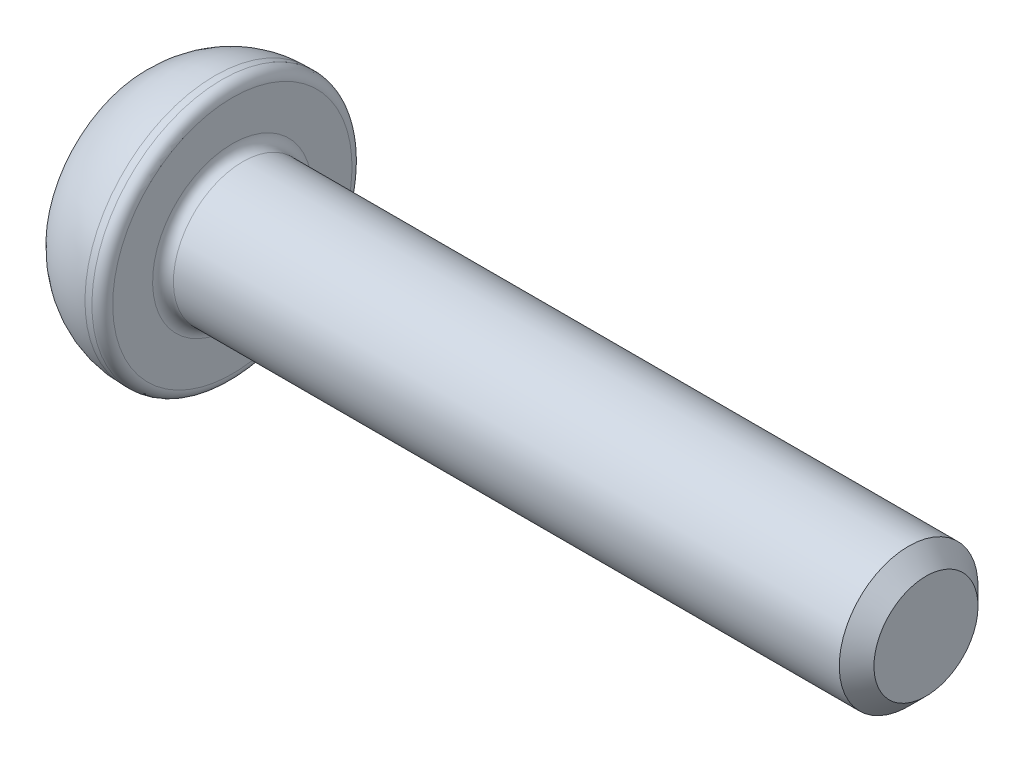
ISO-10303-21;
HEADER;
FILE_DESCRIPTION(('STEP AP214'),'2;1');
FILE_NAME('part.step','',(''),(''),'','','');
FILE_SCHEMA(('AUTOMOTIVE_DESIGN { 1 0 10303 214 1 1 1 1 }'));
ENDSEC;
DATA;
#1=APPLICATION_CONTEXT('core data for automotive mechanical design processes');
#2=APPLICATION_PROTOCOL_DEFINITION('international standard','automotive_design',2000,#1);
#3=PRODUCT_CONTEXT('',#1,'mechanical');
#4=PRODUCT('Part','Part','',(#3));
#5=PRODUCT_RELATED_PRODUCT_CATEGORY('part','',(#4));
#6=PRODUCT_DEFINITION_FORMATION('','',#4);
#7=PRODUCT_DEFINITION_CONTEXT('part definition',#1,'design');
#8=PRODUCT_DEFINITION('design','',#6,#7);
#9=PRODUCT_DEFINITION_SHAPE('','',#8);
#10=(LENGTH_UNIT() NAMED_UNIT(*) SI_UNIT(.MILLI.,.METRE.));
#11=(NAMED_UNIT(*) PLANE_ANGLE_UNIT() SI_UNIT($,.RADIAN.));
#12=(NAMED_UNIT(*) SI_UNIT($,.STERADIAN.) SOLID_ANGLE_UNIT());
#13=UNCERTAINTY_MEASURE_WITH_UNIT(LENGTH_MEASURE(1.E-05),#10,'distance_accuracy_value','');
#14=(GEOMETRIC_REPRESENTATION_CONTEXT(3) GLOBAL_UNCERTAINTY_ASSIGNED_CONTEXT((#13)) GLOBAL_UNIT_ASSIGNED_CONTEXT((#10,
#11,#12)) REPRESENTATION_CONTEXT('',''));
#15=CARTESIAN_POINT('',(0.,0.,0.));
#16=DIRECTION('',(0.,0.,1.));
#17=DIRECTION('',(1.,0.,0.));
#18=AXIS2_PLACEMENT_3D('',#15,#16,#17);
#19=CARTESIAN_POINT('',(0.,0.,0.));
#20=DIRECTION('',(-1.,0.,0.));
#21=DIRECTION('',(0.,-1.,0.));
#22=AXIS2_PLACEMENT_3D('',#19,#20,#21);
#23=PLANE('',#22);
#24=DIRECTION('',(0.,0.866025403784438,-0.5));
#25=VECTOR('',#24,1.);
#26=CARTESIAN_POINT('',(0.,0.,1.44337567297407));
#27=LINE('',#26,#25);
#28=CARTESIAN_POINT('',(0.,0.,1.44337567297407));
#29=VERTEX_POINT('',#28);
#30=CARTESIAN_POINT('',(0.,1.25,0.721687836487032));
#31=VERTEX_POINT('',#30);
#32=EDGE_CURVE('E55',#29,#31,#27,.T.);
#33=ORIENTED_EDGE('',*,*,#32,.F.);
#34=DIRECTION('',(0.,0.866025403784438,0.5));
#35=VECTOR('',#34,1.);
#36=CARTESIAN_POINT('',(0.,-1.25,0.721687836487033));
#37=LINE('',#36,#35);
#38=CARTESIAN_POINT('',(0.,-1.25,0.721687836487033));
#39=VERTEX_POINT('',#38);
#40=EDGE_CURVE('E138',#39,#29,#37,.T.);
#41=ORIENTED_EDGE('',*,*,#40,.F.);
#42=DIRECTION('',(0.,0.,1.));
#43=VECTOR('',#42,1.);
#44=CARTESIAN_POINT('',(0.,-1.25,-0.721687836487032));
#45=LINE('',#44,#43);
#46=CARTESIAN_POINT('',(0.,-1.25,-0.721687836487032));
#47=VERTEX_POINT('',#46);
#48=EDGE_CURVE('E136',#47,#39,#45,.T.);
#49=ORIENTED_EDGE('',*,*,#48,.F.);
#50=DIRECTION('',(0.,-0.866025403784438,0.5));
#51=VECTOR('',#50,1.);
#52=CARTESIAN_POINT('',(0.,0.,-1.44337567297407));
#53=LINE('',#52,#51);
#54=CARTESIAN_POINT('',(0.,0.,-1.44337567297407));
#55=VERTEX_POINT('',#54);
#56=EDGE_CURVE('E103',#55,#47,#53,.T.);
#57=ORIENTED_EDGE('',*,*,#56,.F.);
#58=DIRECTION('',(0.,-0.866025403784438,-0.5));
#59=VECTOR('',#58,1.);
#60=CARTESIAN_POINT('',(0.,1.25,-0.721687836487032));
#61=LINE('',#60,#59);
#62=CARTESIAN_POINT('',(0.,1.25,-0.721687836487032));
#63=VERTEX_POINT('',#62);
#64=EDGE_CURVE('E132',#63,#55,#61,.T.);
#65=ORIENTED_EDGE('',*,*,#64,.F.);
#66=DIRECTION('',(0.,0.,-1.));
#67=VECTOR('',#66,1.);
#68=CARTESIAN_POINT('',(0.,1.25,0.721687836487032));
#69=LINE('',#68,#67);
#70=EDGE_CURVE('E129',#31,#63,#69,.T.);
#71=ORIENTED_EDGE('',*,*,#70,.F.);
#72=EDGE_LOOP('',(#33,#41,#49,#57,#65,#71));
#73=FACE_BOUND('',#72,.T.);
#74=CARTESIAN_POINT('',(0.,0.,0.));
#75=DIRECTION('',(1.,0.,0.));
#76=DIRECTION('',(0.,1.,0.));
#77=AXIS2_PLACEMENT_3D('',#74,#75,#76);
#78=CIRCLE('',#77,2.875);
#79=CARTESIAN_POINT('',(0.,2.875,0.));
#80=VERTEX_POINT('',#79);
#81=EDGE_CURVE('E150',#80,#80,#78,.T.);
#82=ORIENTED_EDGE('',*,*,#81,.F.);
#83=EDGE_LOOP('',(#82));
#84=FACE_BOUND('',#83,.T.);
#85=ADVANCED_FACE('F39',(#73,#84),#23,.T.);
#86=CARTESIAN_POINT('',(2.,0.,0.));
#87=DIRECTION('',(1.,0.,0.));
#88=DIRECTION('',(0.,1.,0.));
#89=AXIS2_PLACEMENT_3D('',#86,#87,#88);
#90=DEGENERATE_TOROIDAL_SURFACE('',#89,1.02678571428571,2.72321428571429,.T.);
#91=ORIENTED_EDGE('',*,*,#81,.T.);
#92=EDGE_LOOP('',(#91));
#93=FACE_BOUND('',#92,.T.);
#94=CARTESIAN_POINT('',(2.,0.,0.));
#95=DIRECTION('',(1.,0.,0.));
#96=DIRECTION('',(0.,1.,0.));
#97=AXIS2_PLACEMENT_3D('',#94,#95,#96);
#98=CIRCLE('',#97,3.75);
#99=CARTESIAN_POINT('',(2.,3.75,0.));
#100=VERTEX_POINT('',#99);
#101=EDGE_CURVE('E142',#100,#100,#98,.T.);
#102=ORIENTED_EDGE('',*,*,#101,.F.);
#103=EDGE_LOOP('',(#102));
#104=FACE_BOUND('',#103,.T.);
#105=ADVANCED_FACE('F179',(#93,#104),#90,.T.);
#106=CARTESIAN_POINT('',(22.5,0.,0.));
#107=DIRECTION('',(1.,0.,0.));
#108=DIRECTION('',(0.,1.,0.));
#109=AXIS2_PLACEMENT_3D('',#106,#107,#108);
#110=CYLINDRICAL_SURFACE('',#109,3.75);
#111=CARTESIAN_POINT('',(2.2,0.,0.));
#112=DIRECTION('',(1.,0.,0.));
#113=DIRECTION('',(0.,1.,0.));
#114=AXIS2_PLACEMENT_3D('',#111,#112,#113);
#115=CIRCLE('',#114,3.75);
#116=CARTESIAN_POINT('',(2.2,3.75,0.));
#117=VERTEX_POINT('',#116);
#118=EDGE_CURVE('E162',#117,#117,#115,.F.);
#119=ORIENTED_EDGE('',*,*,#118,.T.);
#120=EDGE_LOOP('',(#119));
#121=FACE_BOUND('',#120,.T.);
#122=ORIENTED_EDGE('',*,*,#101,.T.);
#123=EDGE_LOOP('',(#122));
#124=FACE_BOUND('',#123,.T.);
#125=ADVANCED_FACE('F185',(#121,#124),#110,.T.);
#126=CARTESIAN_POINT('',(2.5,3.75,0.));
#127=DIRECTION('',(1.,0.,0.));
#128=DIRECTION('',(0.,1.,0.));
#129=AXIS2_PLACEMENT_3D('',#126,#127,#128);
#130=PLANE('',#129);
#131=CARTESIAN_POINT('',(2.5,0.,0.));
#132=DIRECTION('',(1.,0.,0.));
#133=DIRECTION('',(0.,1.,0.));
#134=AXIS2_PLACEMENT_3D('',#131,#132,#133);
#135=CIRCLE('',#134,2.3);
#136=CARTESIAN_POINT('',(2.5,2.3,0.));
#137=VERTEX_POINT('',#136);
#138=EDGE_CURVE('E159',#137,#137,#135,.F.);
#139=ORIENTED_EDGE('',*,*,#138,.T.);
#140=EDGE_LOOP('',(#139));
#141=FACE_BOUND('',#140,.T.);
#142=CARTESIAN_POINT('',(2.5,0.,0.));
#143=DIRECTION('',(1.,0.,0.));
#144=DIRECTION('',(0.,1.,0.));
#145=AXIS2_PLACEMENT_3D('',#142,#143,#144);
#146=CIRCLE('',#145,3.45);
#147=CARTESIAN_POINT('',(2.5,3.45,0.));
#148=VERTEX_POINT('',#147);
#149=EDGE_CURVE('E156',#148,#148,#146,.T.);
#150=ORIENTED_EDGE('',*,*,#149,.T.);
#151=EDGE_LOOP('',(#150));
#152=FACE_BOUND('',#151,.T.);
#153=ADVANCED_FACE('F204',(#141,#152),#130,.T.);
#154=CARTESIAN_POINT('',(22.5,0.,0.));
#155=DIRECTION('',(1.,0.,0.));
#156=DIRECTION('',(0.,1.,0.));
#157=AXIS2_PLACEMENT_3D('',#154,#155,#156);
#158=CYLINDRICAL_SURFACE('',#157,2.);
#159=CARTESIAN_POINT('',(22.,0.,0.));
#160=DIRECTION('',(1.,0.,0.));
#161=DIRECTION('',(0.,1.,0.));
#162=AXIS2_PLACEMENT_3D('',#159,#160,#161);
#163=CIRCLE('',#162,2.);
#164=CARTESIAN_POINT('',(22.,2.,0.));
#165=VERTEX_POINT('',#164);
#166=EDGE_CURVE('E11',#165,#165,#163,.F.);
#167=ORIENTED_EDGE('',*,*,#166,.T.);
#168=EDGE_LOOP('',(#167));
#169=FACE_BOUND('',#168,.T.);
#170=CARTESIAN_POINT('',(2.8,0.,0.));
#171=DIRECTION('',(1.,0.,0.));
#172=DIRECTION('',(0.,1.,0.));
#173=AXIS2_PLACEMENT_3D('',#170,#171,#172);
#174=CIRCLE('',#173,2.);
#175=CARTESIAN_POINT('',(2.8,2.,0.));
#176=VERTEX_POINT('',#175);
#177=EDGE_CURVE('E153',#176,#176,#174,.T.);
#178=ORIENTED_EDGE('',*,*,#177,.T.);
#179=EDGE_LOOP('',(#178));
#180=FACE_BOUND('',#179,.T.);
#181=ADVANCED_FACE('F202',(#169,#180),#158,.T.);
#182=CARTESIAN_POINT('',(22.5,2.,0.));
#183=DIRECTION('',(1.,0.,0.));
#184=DIRECTION('',(0.,1.,0.));
#185=AXIS2_PLACEMENT_3D('',#182,#183,#184);
#186=PLANE('',#185);
#187=CARTESIAN_POINT('',(22.5,0.,0.));
#188=DIRECTION('',(1.,0.,0.));
#189=DIRECTION('',(0.,1.,0.));
#190=AXIS2_PLACEMENT_3D('',#187,#188,#189);
#191=CIRCLE('',#190,1.5);
#192=CARTESIAN_POINT('',(22.5,1.5,0.));
#193=VERTEX_POINT('',#192);
#194=EDGE_CURVE('E48',#193,#193,#191,.T.);
#195=ORIENTED_EDGE('',*,*,#194,.T.);
#196=EDGE_LOOP('',(#195));
#197=FACE_BOUND('',#196,.T.);
#198=ADVANCED_FACE('F167',(#197),#186,.T.);
#199=CARTESIAN_POINT('',(1.5,0.,1.44337567297407));
#200=DIRECTION('',(0.,0.5,0.866025403784438));
#201=DIRECTION('',(0.,-0.866025403784439,0.5));
#202=AXIS2_PLACEMENT_3D('',#199,#200,#201);
#203=PLANE('',#202);
#204=ORIENTED_EDGE('',*,*,#32,.T.);
#205=DIRECTION('',(-1.,0.,0.));
#206=VECTOR('',#205,1.);
#207=CARTESIAN_POINT('',(1.5,1.25,0.721687836487032));
#208=LINE('',#207,#206);
#209=CARTESIAN_POINT('',(1.5,1.25,0.721687836487032));
#210=VERTEX_POINT('',#209);
#211=EDGE_CURVE('E85',#210,#31,#208,.T.);
#212=ORIENTED_EDGE('',*,*,#211,.F.);
#213=DIRECTION('',(0.,0.866025403784438,-0.5));
#214=VECTOR('',#213,1.);
#215=CARTESIAN_POINT('',(1.5,0.,1.44337567297407));
#216=LINE('',#215,#214);
#217=CARTESIAN_POINT('',(1.5,0.,1.44337567297407));
#218=VERTEX_POINT('',#217);
#219=EDGE_CURVE('E140',#218,#210,#216,.T.);
#220=ORIENTED_EDGE('',*,*,#219,.F.);
#221=DIRECTION('',(-1.,0.,0.));
#222=VECTOR('',#221,1.);
#223=CARTESIAN_POINT('',(1.5,0.,1.44337567297407));
#224=LINE('',#223,#222);
#225=EDGE_CURVE('E63',#218,#29,#224,.T.);
#226=ORIENTED_EDGE('',*,*,#225,.T.);
#227=EDGE_LOOP('',(#204,#212,#220,#226));
#228=FACE_BOUND('',#227,.T.);
#229=ADVANCED_FACE('F211',(#228),#203,.F.);
#230=CARTESIAN_POINT('',(1.5,-1.25,0.721687836487033));
#231=DIRECTION('',(0.,-0.5,0.866025403784439));
#232=DIRECTION('',(0.,-0.866025403784439,-0.5));
#233=AXIS2_PLACEMENT_3D('',#230,#231,#232);
#234=PLANE('',#233);
#235=ORIENTED_EDGE('',*,*,#40,.T.);
#236=ORIENTED_EDGE('',*,*,#225,.F.);
#237=DIRECTION('',(0.,0.866025403784438,0.5));
#238=VECTOR('',#237,1.);
#239=CARTESIAN_POINT('',(1.5,-1.25,0.721687836487033));
#240=LINE('',#239,#238);
#241=CARTESIAN_POINT('',(1.5,-1.25,0.721687836487033));
#242=VERTEX_POINT('',#241);
#243=EDGE_CURVE('E115',#242,#218,#240,.T.);
#244=ORIENTED_EDGE('',*,*,#243,.F.);
#245=DIRECTION('',(-1.,0.,0.));
#246=VECTOR('',#245,1.);
#247=CARTESIAN_POINT('',(1.5,-1.25,0.721687836487033));
#248=LINE('',#247,#246);
#249=EDGE_CURVE('E107',#242,#39,#248,.T.);
#250=ORIENTED_EDGE('',*,*,#249,.T.);
#251=EDGE_LOOP('',(#235,#236,#244,#250));
#252=FACE_BOUND('',#251,.T.);
#253=ADVANCED_FACE('F270',(#252),#234,.F.);
#254=CARTESIAN_POINT('',(1.5,-1.25,-0.721687836487032));
#255=DIRECTION('',(0.,-1.,0.));
#256=DIRECTION('',(0.,0.,-1.));
#257=AXIS2_PLACEMENT_3D('',#254,#255,#256);
#258=PLANE('',#257);
#259=ORIENTED_EDGE('',*,*,#48,.T.);
#260=ORIENTED_EDGE('',*,*,#249,.F.);
#261=DIRECTION('',(0.,0.,1.));
#262=VECTOR('',#261,1.);
#263=CARTESIAN_POINT('',(1.5,-1.25,-0.721687836487032));
#264=LINE('',#263,#262);
#265=CARTESIAN_POINT('',(1.5,-1.25,-0.721687836487032));
#266=VERTEX_POINT('',#265);
#267=EDGE_CURVE('E111',#266,#242,#264,.T.);
#268=ORIENTED_EDGE('',*,*,#267,.F.);
#269=DIRECTION('',(-1.,0.,0.));
#270=VECTOR('',#269,1.);
#271=CARTESIAN_POINT('',(1.5,-1.25,-0.721687836487032));
#272=LINE('',#271,#270);
#273=EDGE_CURVE('E96',#266,#47,#272,.T.);
#274=ORIENTED_EDGE('',*,*,#273,.T.);
#275=EDGE_LOOP('',(#259,#260,#268,#274));
#276=FACE_BOUND('',#275,.T.);
#277=ADVANCED_FACE('F112',(#276),#258,.F.);
#278=CARTESIAN_POINT('',(1.5,0.,-1.44337567297407));
#279=DIRECTION('',(0.,-0.5,-0.866025403784439));
#280=DIRECTION('',(0.,0.866025403784439,-0.5));
#281=AXIS2_PLACEMENT_3D('',#278,#279,#280);
#282=PLANE('',#281);
#283=ORIENTED_EDGE('',*,*,#56,.T.);
#284=ORIENTED_EDGE('',*,*,#273,.F.);
#285=DIRECTION('',(0.,-0.866025403784438,0.5));
#286=VECTOR('',#285,1.);
#287=CARTESIAN_POINT('',(1.5,0.,-1.44337567297407));
#288=LINE('',#287,#286);
#289=CARTESIAN_POINT('',(1.5,0.,-1.44337567297407));
#290=VERTEX_POINT('',#289);
#291=EDGE_CURVE('E100',#290,#266,#288,.T.);
#292=ORIENTED_EDGE('',*,*,#291,.F.);
#293=DIRECTION('',(-1.,0.,0.));
#294=VECTOR('',#293,1.);
#295=CARTESIAN_POINT('',(1.5,0.,-1.44337567297407));
#296=LINE('',#295,#294);
#297=EDGE_CURVE('E108',#290,#55,#296,.T.);
#298=ORIENTED_EDGE('',*,*,#297,.T.);
#299=EDGE_LOOP('',(#283,#284,#292,#298));
#300=FACE_BOUND('',#299,.T.);
#301=ADVANCED_FACE('F98',(#300),#282,.F.);
#302=CARTESIAN_POINT('',(1.5,1.25,-0.721687836487032));
#303=DIRECTION('',(0.,0.5,-0.866025403784438));
#304=DIRECTION('',(0.,0.866025403784439,0.5));
#305=AXIS2_PLACEMENT_3D('',#302,#303,#304);
#306=PLANE('',#305);
#307=ORIENTED_EDGE('',*,*,#64,.T.);
#308=ORIENTED_EDGE('',*,*,#297,.F.);
#309=DIRECTION('',(0.,-0.866025403784438,-0.5));
#310=VECTOR('',#309,1.);
#311=CARTESIAN_POINT('',(1.5,1.25,-0.721687836487032));
#312=LINE('',#311,#310);
#313=CARTESIAN_POINT('',(1.5,1.25,-0.721687836487032));
#314=VERTEX_POINT('',#313);
#315=EDGE_CURVE('E121',#314,#290,#312,.T.);
#316=ORIENTED_EDGE('',*,*,#315,.F.);
#317=DIRECTION('',(-1.,0.,0.));
#318=VECTOR('',#317,1.);
#319=CARTESIAN_POINT('',(1.5,1.25,-0.721687836487032));
#320=LINE('',#319,#318);
#321=EDGE_CURVE('E145',#314,#63,#320,.T.);
#322=ORIENTED_EDGE('',*,*,#321,.T.);
#323=EDGE_LOOP('',(#307,#308,#316,#322));
#324=FACE_BOUND('',#323,.T.);
#325=ADVANCED_FACE('F287',(#324),#306,.F.);
#326=CARTESIAN_POINT('',(1.5,1.25,0.721687836487032));
#327=DIRECTION('',(0.,1.,0.));
#328=DIRECTION('',(0.,0.,1.));
#329=AXIS2_PLACEMENT_3D('',#326,#327,#328);
#330=PLANE('',#329);
#331=ORIENTED_EDGE('',*,*,#70,.T.);
#332=ORIENTED_EDGE('',*,*,#321,.F.);
#333=DIRECTION('',(0.,0.,-1.));
#334=VECTOR('',#333,1.);
#335=CARTESIAN_POINT('',(1.5,1.25,0.721687836487032));
#336=LINE('',#335,#334);
#337=EDGE_CURVE('E123',#210,#314,#336,.T.);
#338=ORIENTED_EDGE('',*,*,#337,.F.);
#339=ORIENTED_EDGE('',*,*,#211,.T.);
#340=EDGE_LOOP('',(#331,#332,#338,#339));
#341=FACE_BOUND('',#340,.T.);
#342=ADVANCED_FACE('F196',(#341),#330,.F.);
#343=CARTESIAN_POINT('',(1.5,0.,0.));
#344=DIRECTION('',(-1.,0.,0.));
#345=DIRECTION('',(0.,0.,1.));
#346=AXIS2_PLACEMENT_3D('',#343,#344,#345);
#347=PLANE('',#346);
#348=ORIENTED_EDGE('',*,*,#219,.T.);
#349=ORIENTED_EDGE('',*,*,#337,.T.);
#350=ORIENTED_EDGE('',*,*,#315,.T.);
#351=ORIENTED_EDGE('',*,*,#291,.T.);
#352=ORIENTED_EDGE('',*,*,#267,.T.);
#353=ORIENTED_EDGE('',*,*,#243,.T.);
#354=EDGE_LOOP('',(#348,#349,#350,#351,#352,#353));
#355=FACE_BOUND('',#354,.T.);
#356=ADVANCED_FACE('F118',(#355),#347,.T.);
#357=CARTESIAN_POINT('',(2.8,0.,0.));
#358=DIRECTION('',(1.,0.,0.));
#359=DIRECTION('',(0.,1.,0.));
#360=AXIS2_PLACEMENT_3D('',#357,#358,#359);
#361=TOROIDAL_SURFACE('',#360,2.3,0.3);
#362=ORIENTED_EDGE('',*,*,#138,.F.);
#363=EDGE_LOOP('',(#362));
#364=FACE_BOUND('',#363,.T.);
#365=ORIENTED_EDGE('',*,*,#177,.F.);
#366=EDGE_LOOP('',(#365));
#367=FACE_BOUND('',#366,.T.);
#368=ADVANCED_FACE('F175',(#364,#367),#361,.F.);
#369=CARTESIAN_POINT('',(2.2,0.,0.));
#370=DIRECTION('',(1.,0.,0.));
#371=DIRECTION('',(0.,1.,0.));
#372=AXIS2_PLACEMENT_3D('',#369,#370,#371);
#373=TOROIDAL_SURFACE('',#372,3.45,0.3);
#374=ORIENTED_EDGE('',*,*,#118,.F.);
#375=EDGE_LOOP('',(#374));
#376=FACE_BOUND('',#375,.T.);
#377=ORIENTED_EDGE('',*,*,#149,.F.);
#378=EDGE_LOOP('',(#377));
#379=FACE_BOUND('',#378,.T.);
#380=ADVANCED_FACE('F170',(#376,#379),#373,.T.);
#381=CARTESIAN_POINT('',(22.5,0.,0.));
#382=DIRECTION('',(-1.,0.,0.));
#383=DIRECTION('',(0.,-1.,0.));
#384=AXIS2_PLACEMENT_3D('',#381,#382,#383);
#385=CONICAL_SURFACE('',#384,1.5,0.785398163397444);
#386=ORIENTED_EDGE('',*,*,#166,.F.);
#387=EDGE_LOOP('',(#386));
#388=FACE_BOUND('',#387,.T.);
#389=ORIENTED_EDGE('',*,*,#194,.F.);
#390=EDGE_LOOP('',(#389));
#391=FACE_BOUND('',#390,.T.);
#392=ADVANCED_FACE('F42',(#388,#391),#385,.T.);
#393=CLOSED_SHELL('',(#85,#105,#125,#153,#181,#198,#229,#253,#277,#301,#325,#342,#356,#368,#380,#392));
#394=MANIFOLD_SOLID_BREP('B2',#393);
#395=ADVANCED_BREP_SHAPE_REPRESENTATION('',(#18,#394),#14);
#396=SHAPE_DEFINITION_REPRESENTATION(#9,#395);
ENDSEC;
END-ISO-10303-21;
